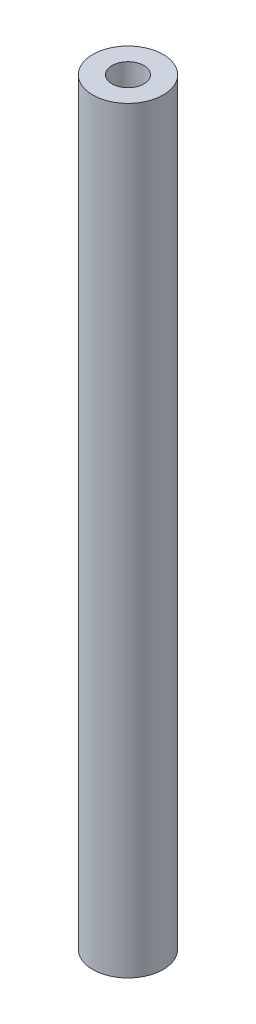
ISO-10303-21;
HEADER;
FILE_DESCRIPTION(('STEP AP214'),'2;1');
FILE_NAME('part.step','',(''),(''),'','','');
FILE_SCHEMA(('AUTOMOTIVE_DESIGN { 1 0 10303 214 1 1 1 1 }'));
ENDSEC;
DATA;
#1=APPLICATION_CONTEXT('core data for automotive mechanical design processes');
#2=APPLICATION_PROTOCOL_DEFINITION('international standard','automotive_design',2000,#1);
#3=PRODUCT_CONTEXT('',#1,'mechanical');
#4=PRODUCT('Part','Part','',(#3));
#5=PRODUCT_RELATED_PRODUCT_CATEGORY('part','',(#4));
#6=PRODUCT_DEFINITION_FORMATION('','',#4);
#7=PRODUCT_DEFINITION_CONTEXT('part definition',#1,'design');
#8=PRODUCT_DEFINITION('design','',#6,#7);
#9=PRODUCT_DEFINITION_SHAPE('','',#8);
#10=(LENGTH_UNIT() NAMED_UNIT(*) SI_UNIT(.MILLI.,.METRE.));
#11=(NAMED_UNIT(*) PLANE_ANGLE_UNIT() SI_UNIT($,.RADIAN.));
#12=(NAMED_UNIT(*) SI_UNIT($,.STERADIAN.) SOLID_ANGLE_UNIT());
#13=UNCERTAINTY_MEASURE_WITH_UNIT(LENGTH_MEASURE(1.E-05),#10,'distance_accuracy_value','');
#14=(GEOMETRIC_REPRESENTATION_CONTEXT(3) GLOBAL_UNCERTAINTY_ASSIGNED_CONTEXT((#13)) GLOBAL_UNIT_ASSIGNED_CONTEXT((#10,
#11,#12)) REPRESENTATION_CONTEXT('',''));
#15=CARTESIAN_POINT('',(0.,0.,0.));
#16=DIRECTION('',(0.,0.,1.));
#17=DIRECTION('',(1.,0.,0.));
#18=AXIS2_PLACEMENT_3D('',#15,#16,#17);
#19=CARTESIAN_POINT('',(0.,102.616,0.));
#20=DIRECTION('',(0.,1.,0.));
#21=DIRECTION('',(0.,0.,1.));
#22=AXIS2_PLACEMENT_3D('',#19,#20,#21);
#23=PLANE('',#22);
#24=CARTESIAN_POINT('',(0.,102.616,0.));
#25=DIRECTION('',(0.,1.,0.));
#26=DIRECTION('',(0.,0.,1.));
#27=AXIS2_PLACEMENT_3D('',#24,#25,#26);
#28=CIRCLE('',#27,4.7625);
#29=CARTESIAN_POINT('',(0.,102.616,4.7625));
#30=VERTEX_POINT('',#29);
#31=EDGE_CURVE('E10',#30,#30,#28,.T.);
#32=ORIENTED_EDGE('',*,*,#31,.T.);
#33=EDGE_LOOP('',(#32));
#34=FACE_BOUND('',#33,.T.);
#35=CARTESIAN_POINT('',(0.,102.616,0.));
#36=DIRECTION('',(0.,1.,0.));
#37=DIRECTION('',(0.,0.,1.));
#38=AXIS2_PLACEMENT_3D('',#35,#36,#37);
#39=CIRCLE('',#38,2.159);
#40=CARTESIAN_POINT('',(0.,102.616,2.159));
#41=VERTEX_POINT('',#40);
#42=EDGE_CURVE('E42',#41,#41,#39,.T.);
#43=ORIENTED_EDGE('',*,*,#42,.F.);
#44=EDGE_LOOP('',(#43));
#45=FACE_BOUND('',#44,.T.);
#46=ADVANCED_FACE('F31',(#34,#45),#23,.T.);
#47=CARTESIAN_POINT('',(0.,0.,0.));
#48=DIRECTION('',(0.,1.,0.));
#49=DIRECTION('',(0.,0.,1.));
#50=AXIS2_PLACEMENT_3D('',#47,#48,#49);
#51=PLANE('',#50);
#52=CARTESIAN_POINT('',(0.,0.,0.));
#53=DIRECTION('',(0.,1.,0.));
#54=DIRECTION('',(0.,0.,1.));
#55=AXIS2_PLACEMENT_3D('',#52,#53,#54);
#56=CIRCLE('',#55,4.7625);
#57=CARTESIAN_POINT('',(0.,0.,4.7625));
#58=VERTEX_POINT('',#57);
#59=EDGE_CURVE('E35',#58,#58,#56,.T.);
#60=ORIENTED_EDGE('',*,*,#59,.F.);
#61=EDGE_LOOP('',(#60));
#62=FACE_BOUND('',#61,.T.);
#63=CARTESIAN_POINT('',(0.,0.,0.));
#64=DIRECTION('',(0.,1.,0.));
#65=DIRECTION('',(0.,0.,1.));
#66=AXIS2_PLACEMENT_3D('',#63,#64,#65);
#67=CIRCLE('',#66,2.159);
#68=CARTESIAN_POINT('',(0.,0.,2.159));
#69=VERTEX_POINT('',#68);
#70=EDGE_CURVE('E44',#69,#69,#67,.T.);
#71=ORIENTED_EDGE('',*,*,#70,.T.);
#72=EDGE_LOOP('',(#71));
#73=FACE_BOUND('',#72,.T.);
#74=ADVANCED_FACE('F54',(#62,#73),#51,.F.);
#75=CARTESIAN_POINT('',(0.,102.616,0.));
#76=DIRECTION('',(0.,-1.,0.));
#77=DIRECTION('',(0.,0.,-1.));
#78=AXIS2_PLACEMENT_3D('',#75,#76,#77);
#79=CYLINDRICAL_SURFACE('',#78,4.7625);
#80=ORIENTED_EDGE('',*,*,#31,.F.);
#81=EDGE_LOOP('',(#80));
#82=FACE_BOUND('',#81,.T.);
#83=ORIENTED_EDGE('',*,*,#59,.T.);
#84=EDGE_LOOP('',(#83));
#85=FACE_BOUND('',#84,.T.);
#86=ADVANCED_FACE('F33',(#82,#85),#79,.T.);
#87=CARTESIAN_POINT('',(0.,102.616,0.));
#88=DIRECTION('',(0.,-1.,0.));
#89=DIRECTION('',(0.,0.,-1.));
#90=AXIS2_PLACEMENT_3D('',#87,#88,#89);
#91=CYLINDRICAL_SURFACE('',#90,2.159);
#92=ORIENTED_EDGE('',*,*,#42,.T.);
#93=EDGE_LOOP('',(#92));
#94=FACE_BOUND('',#93,.T.);
#95=ORIENTED_EDGE('',*,*,#70,.F.);
#96=EDGE_LOOP('',(#95));
#97=FACE_BOUND('',#96,.T.);
#98=ADVANCED_FACE('F50',(#94,#97),#91,.F.);
#99=CLOSED_SHELL('',(#46,#74,#86,#98));
#100=MANIFOLD_SOLID_BREP('B2',#99);
#101=ADVANCED_BREP_SHAPE_REPRESENTATION('',(#18,#100),#14);
#102=SHAPE_DEFINITION_REPRESENTATION(#9,#101);
ENDSEC;
END-ISO-10303-21;
